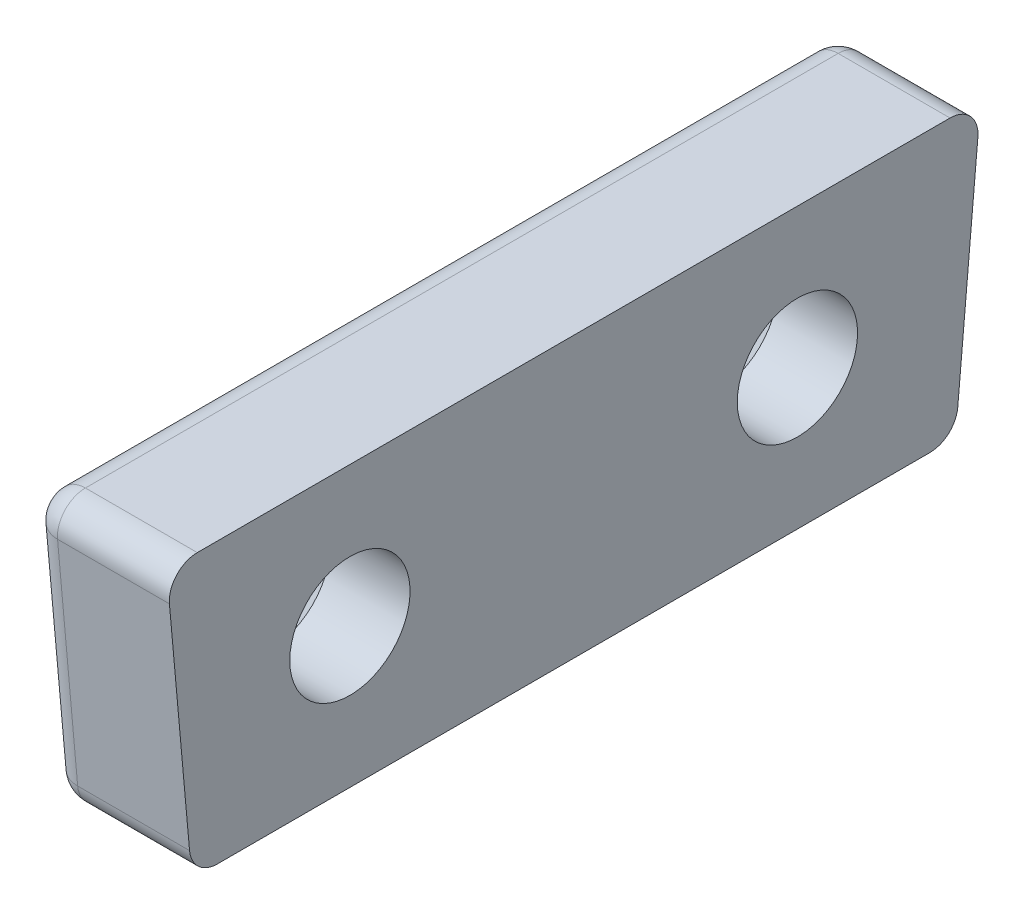
ISO-10303-21;
HEADER;
FILE_DESCRIPTION(('STEP AP214'),'2;1');
FILE_NAME('part.step','',(''),(''),'','','');
FILE_SCHEMA(('AUTOMOTIVE_DESIGN { 1 0 10303 214 1 1 1 1 }'));
ENDSEC;
DATA;
#1=APPLICATION_CONTEXT('core data for automotive mechanical design processes');
#2=APPLICATION_PROTOCOL_DEFINITION('international standard','automotive_design',2000,#1);
#3=PRODUCT_CONTEXT('',#1,'mechanical');
#4=PRODUCT('Part','Part','',(#3));
#5=PRODUCT_RELATED_PRODUCT_CATEGORY('part','',(#4));
#6=PRODUCT_DEFINITION_FORMATION('','',#4);
#7=PRODUCT_DEFINITION_CONTEXT('part definition',#1,'design');
#8=PRODUCT_DEFINITION('design','',#6,#7);
#9=PRODUCT_DEFINITION_SHAPE('','',#8);
#10=(LENGTH_UNIT() NAMED_UNIT(*) SI_UNIT(.MILLI.,.METRE.));
#11=(NAMED_UNIT(*) PLANE_ANGLE_UNIT() SI_UNIT($,.RADIAN.));
#12=(NAMED_UNIT(*) SI_UNIT($,.STERADIAN.) SOLID_ANGLE_UNIT());
#13=UNCERTAINTY_MEASURE_WITH_UNIT(LENGTH_MEASURE(1.E-05),#10,'distance_accuracy_value','');
#14=(GEOMETRIC_REPRESENTATION_CONTEXT(3) GLOBAL_UNCERTAINTY_ASSIGNED_CONTEXT((#13)) GLOBAL_UNIT_ASSIGNED_CONTEXT((#10,
#11,#12)) REPRESENTATION_CONTEXT('',''));
#15=CARTESIAN_POINT('',(0.,0.,0.));
#16=DIRECTION('',(0.,0.,1.));
#17=DIRECTION('',(1.,0.,0.));
#18=AXIS2_PLACEMENT_3D('',#15,#16,#17);
#19=CARTESIAN_POINT('',(0.,0.,0.));
#20=DIRECTION('',(1.,0.,0.));
#21=DIRECTION('',(0.,0.,-1.));
#22=AXIS2_PLACEMENT_3D('',#19,#20,#21);
#23=PLANE('',#22);
#24=CARTESIAN_POINT('',(0.,13.,-38.));
#25=DIRECTION('',(-1.,0.,0.));
#26=DIRECTION('',(0.,0.,1.));
#27=AXIS2_PLACEMENT_3D('',#24,#25,#26);
#28=CIRCLE('',#27,4.3);
#29=CARTESIAN_POINT('',(0.,9.,-36.422026616194));
#30=VERTEX_POINT('',#29);
#31=CARTESIAN_POINT('',(0.,17.,-36.422026616194));
#32=VERTEX_POINT('',#31);
#33=EDGE_CURVE('E348',#30,#32,#28,.T.);
#34=ORIENTED_EDGE('',*,*,#33,.F.);
#35=DIRECTION('',(0.,0.,-1.));
#36=VECTOR('',#35,1.);
#37=CARTESIAN_POINT('',(0.,9.,0.));
#38=LINE('',#37,#36);
#39=CARTESIAN_POINT('',(0.,9.,-23.577973383806));
#40=VERTEX_POINT('',#39);
#41=EDGE_CURVE('E190',#30,#40,#38,.F.);
#42=ORIENTED_EDGE('',*,*,#41,.T.);
#43=CARTESIAN_POINT('',(0.,13.,-22.));
#44=DIRECTION('',(-1.,0.,0.));
#45=DIRECTION('',(0.,0.,1.));
#46=AXIS2_PLACEMENT_3D('',#43,#44,#45);
#47=CIRCLE('',#46,4.3);
#48=CARTESIAN_POINT('',(0.,17.,-23.577973383806));
#49=VERTEX_POINT('',#48);
#50=EDGE_CURVE('E312',#49,#40,#47,.T.);
#51=ORIENTED_EDGE('',*,*,#50,.F.);
#52=DIRECTION('',(0.,0.,1.));
#53=VECTOR('',#52,1.);
#54=CARTESIAN_POINT('',(0.,17.,0.));
#55=LINE('',#54,#53);
#56=EDGE_CURVE('E188',#49,#32,#55,.F.);
#57=ORIENTED_EDGE('',*,*,#56,.T.);
#58=EDGE_LOOP('',(#34,#42,#51,#57));
#59=FACE_BOUND('',#58,.T.);
#60=ADVANCED_FACE('F45',(#59),#23,.F.);
#61=DIRECTION('',(0.,-0.995979773230106,0.0895784087629745));
#62=VECTOR('',#61,1.);
#63=CARTESIAN_POINT('',(0.,8.08957840876297,-42.6549204081191));
#64=LINE('',#63,#62);
#65=CARTESIAN_POINT('',(0.,17.,-43.4563236183084));
#66=VERTEX_POINT('',#65);
#67=CARTESIAN_POINT('',(0.,9.,-42.736803715028));
#68=VERTEX_POINT('',#67);
#69=EDGE_CURVE('E181',#66,#68,#64,.T.);
#70=ORIENTED_EDGE('',*,*,#69,.T.);
#71=DIRECTION('',(0.,0.,-1.));
#72=VECTOR('',#71,1.);
#73=CARTESIAN_POINT('',(0.,9.,0.));
#74=LINE('',#73,#72);
#75=CARTESIAN_POINT('',(0.,9.,-39.577973383806));
#76=VERTEX_POINT('',#75);
#77=EDGE_CURVE('E185',#68,#76,#74,.F.);
#78=ORIENTED_EDGE('',*,*,#77,.T.);
#79=CARTESIAN_POINT('',(0.,17.,-39.577973383806));
#80=VERTEX_POINT('',#79);
#81=EDGE_CURVE('E351',#80,#76,#28,.T.);
#82=ORIENTED_EDGE('',*,*,#81,.F.);
#83=DIRECTION('',(0.,0.,1.));
#84=VECTOR('',#83,1.);
#85=CARTESIAN_POINT('',(0.,17.,0.));
#86=LINE('',#85,#84);
#87=EDGE_CURVE('E183',#80,#66,#86,.F.);
#88=ORIENTED_EDGE('',*,*,#87,.T.);
#89=EDGE_LOOP('',(#70,#78,#82,#88));
#90=FACE_BOUND('',#89,.T.);
#91=ADVANCED_FACE('F286',(#90),#23,.F.);
#92=CARTESIAN_POINT('',(5.,-3.8302640457931,-42.5868863760978));
#93=DIRECTION('',(0.,-0.0895784087629745,-0.995979773230106));
#94=DIRECTION('',(0.,0.995979773230106,-0.0895784087629745));
#95=AXIS2_PLACEMENT_3D('',#92,#93,#94);
#96=PLANE('',#95);
#97=DIRECTION('',(0.,-0.995979773230106,0.0895784087629745));
#98=VECTOR('',#97,1.);
#99=CARTESIAN_POINT('',(5.,-3.8302640457931,-42.5868863760978));
#100=LINE('',#99,#98);
#101=CARTESIAN_POINT('',(5.,16.910421591237,-44.4523033915385));
#102=VERTEX_POINT('',#101);
#103=CARTESIAN_POINT('',(5.,8.91042159123703,-43.7327834882581));
#104=VERTEX_POINT('',#103);
#105=EDGE_CURVE('E368',#102,#104,#100,.T.);
#106=ORIENTED_EDGE('',*,*,#105,.T.);
#107=DIRECTION('',(-1.,0.,0.));
#108=VECTOR('',#107,1.);
#109=CARTESIAN_POINT('',(0.,8.91042159123703,-43.7327834882581));
#110=LINE('',#109,#108);
#111=CARTESIAN_POINT('',(1.,8.91042159123703,-43.7327834882581));
#112=VERTEX_POINT('',#111);
#113=EDGE_CURVE('E391',#104,#112,#110,.T.);
#114=ORIENTED_EDGE('',*,*,#113,.T.);
#115=DIRECTION('',(0.,-0.995979773230106,0.0895784087629745));
#116=VECTOR('',#115,1.);
#117=CARTESIAN_POINT('',(1.,18.,-44.5503000604497));
#118=LINE('',#117,#116);
#119=CARTESIAN_POINT('',(1.,16.910421591237,-44.4523033915385));
#120=VERTEX_POINT('',#119);
#121=EDGE_CURVE('E396',#112,#120,#118,.F.);
#122=ORIENTED_EDGE('',*,*,#121,.T.);
#123=DIRECTION('',(-1.,0.,0.));
#124=VECTOR('',#123,1.);
#125=CARTESIAN_POINT('',(5.,16.910421591237,-44.4523033915385));
#126=LINE('',#125,#124);
#127=EDGE_CURVE('E394',#120,#102,#126,.F.);
#128=ORIENTED_EDGE('',*,*,#127,.T.);
#129=EDGE_LOOP('',(#106,#114,#122,#128));
#130=FACE_BOUND('',#129,.T.);
#131=ADVANCED_FACE('F249',(#130),#96,.T.);
#132=CARTESIAN_POINT('',(5.,18.,0.));
#133=DIRECTION('',(0.,-1.,0.));
#134=DIRECTION('',(0.,0.,-1.));
#135=AXIS2_PLACEMENT_3D('',#132,#133,#134);
#136=PLANE('',#135);
#137=DIRECTION('',(0.,0.,1.));
#138=VECTOR('',#137,1.);
#139=CARTESIAN_POINT('',(1.,18.,0.));
#140=LINE('',#139,#138);
#141=CARTESIAN_POINT('',(1.,18.,-43.4563236183084));
#142=VERTEX_POINT('',#141);
#143=CARTESIAN_POINT('',(1.,18.,-16.5436763816916));
#144=VERTEX_POINT('',#143);
#145=EDGE_CURVE('E401',#142,#144,#140,.T.);
#146=ORIENTED_EDGE('',*,*,#145,.T.);
#147=DIRECTION('',(-1.,0.,0.));
#148=VECTOR('',#147,1.);
#149=CARTESIAN_POINT('',(5.,18.,-16.5436763816916));
#150=LINE('',#149,#148);
#151=CARTESIAN_POINT('',(5.,18.,-16.5436763816916));
#152=VERTEX_POINT('',#151);
#153=EDGE_CURVE('E382',#144,#152,#150,.F.);
#154=ORIENTED_EDGE('',*,*,#153,.T.);
#155=DIRECTION('',(0.,0.,1.));
#156=VECTOR('',#155,1.);
#157=CARTESIAN_POINT('',(5.,18.,0.));
#158=LINE('',#157,#156);
#159=CARTESIAN_POINT('',(5.,18.,-43.4563236183084));
#160=VERTEX_POINT('',#159);
#161=EDGE_CURVE('E371',#160,#152,#158,.T.);
#162=ORIENTED_EDGE('',*,*,#161,.F.);
#163=DIRECTION('',(-1.,0.,0.));
#164=VECTOR('',#163,1.);
#165=CARTESIAN_POINT('',(0.,18.,-43.4563236183084));
#166=LINE('',#165,#164);
#167=EDGE_CURVE('E240',#160,#142,#166,.T.);
#168=ORIENTED_EDGE('',*,*,#167,.T.);
#169=EDGE_LOOP('',(#146,#154,#162,#168));
#170=FACE_BOUND('',#169,.T.);
#171=ADVANCED_FACE('F403',(#170),#136,.F.);
#172=CARTESIAN_POINT('',(5.,1.52283294897056,-16.9316561449118));
#173=DIRECTION('',(0.,0.0895784087629742,-0.995979773230106));
#174=DIRECTION('',(0.,0.995979773230106,0.0895784087629742));
#175=AXIS2_PLACEMENT_3D('',#172,#173,#174);
#176=PLANE('',#175);
#177=DIRECTION('',(0.,-0.995979773230106,-0.0895784087629742));
#178=VECTOR('',#177,1.);
#179=CARTESIAN_POINT('',(5.,1.52283294897056,-16.9316561449118));
#180=LINE('',#179,#178);
#181=CARTESIAN_POINT('',(5.,16.910421591237,-15.5476966084615));
#182=VERTEX_POINT('',#181);
#183=CARTESIAN_POINT('',(5.,8.91042159123703,-16.2672165117419));
#184=VERTEX_POINT('',#183);
#185=EDGE_CURVE('E153',#182,#184,#180,.T.);
#186=ORIENTED_EDGE('',*,*,#185,.F.);
#187=DIRECTION('',(-1.,0.,0.));
#188=VECTOR('',#187,1.);
#189=CARTESIAN_POINT('',(5.,16.910421591237,-15.5476966084615));
#190=LINE('',#189,#188);
#191=CARTESIAN_POINT('',(1.,16.910421591237,-15.5476966084615));
#192=VERTEX_POINT('',#191);
#193=EDGE_CURVE('E62',#182,#192,#190,.T.);
#194=ORIENTED_EDGE('',*,*,#193,.T.);
#195=DIRECTION('',(0.,-0.995979773230106,-0.0895784087629742));
#196=VECTOR('',#195,1.);
#197=CARTESIAN_POINT('',(1.,1.52283294897056,-16.9316561449118));
#198=LINE('',#197,#196);
#199=CARTESIAN_POINT('',(1.,8.91042159123703,-16.2672165117419));
#200=VERTEX_POINT('',#199);
#201=EDGE_CURVE('E67',#192,#200,#198,.T.);
#202=ORIENTED_EDGE('',*,*,#201,.T.);
#203=DIRECTION('',(-1.,0.,0.));
#204=VECTOR('',#203,1.);
#205=CARTESIAN_POINT('',(5.,8.91042159123703,-16.2672165117419));
#206=LINE('',#205,#204);
#207=EDGE_CURVE('E385',#200,#184,#206,.F.);
#208=ORIENTED_EDGE('',*,*,#207,.T.);
#209=EDGE_LOOP('',(#186,#194,#202,#208));
#210=FACE_BOUND('',#209,.T.);
#211=ADVANCED_FACE('F533',(#210),#176,.F.);
#212=CARTESIAN_POINT('',(5.,8.,0.));
#213=DIRECTION('',(0.,1.,0.));
#214=DIRECTION('',(0.,0.,1.));
#215=AXIS2_PLACEMENT_3D('',#212,#213,#214);
#216=PLANE('',#215);
#217=DIRECTION('',(0.,0.,-1.));
#218=VECTOR('',#217,1.);
#219=CARTESIAN_POINT('',(5.,8.,0.));
#220=LINE('',#219,#218);
#221=CARTESIAN_POINT('',(5.,8.,-17.263196284972));
#222=VERTEX_POINT('',#221);
#223=CARTESIAN_POINT('',(5.,8.,-42.736803715028));
#224=VERTEX_POINT('',#223);
#225=EDGE_CURVE('E151',#222,#224,#220,.T.);
#226=ORIENTED_EDGE('',*,*,#225,.F.);
#227=DIRECTION('',(-1.,0.,0.));
#228=VECTOR('',#227,1.);
#229=CARTESIAN_POINT('',(5.,8.,-17.263196284972));
#230=LINE('',#229,#228);
#231=CARTESIAN_POINT('',(1.,8.,-17.263196284972));
#232=VERTEX_POINT('',#231);
#233=EDGE_CURVE('E161',#222,#232,#230,.T.);
#234=ORIENTED_EDGE('',*,*,#233,.T.);
#235=DIRECTION('',(0.,0.,-1.));
#236=VECTOR('',#235,1.);
#237=CARTESIAN_POINT('',(1.,8.,0.));
#238=LINE('',#237,#236);
#239=CARTESIAN_POINT('',(1.,8.,-42.736803715028));
#240=VERTEX_POINT('',#239);
#241=EDGE_CURVE('E171',#232,#240,#238,.T.);
#242=ORIENTED_EDGE('',*,*,#241,.T.);
#243=DIRECTION('',(-1.,0.,0.));
#244=VECTOR('',#243,1.);
#245=CARTESIAN_POINT('',(5.,8.,-42.736803715028));
#246=LINE('',#245,#244);
#247=EDGE_CURVE('E164',#240,#224,#246,.F.);
#248=ORIENTED_EDGE('',*,*,#247,.T.);
#249=EDGE_LOOP('',(#226,#234,#242,#248));
#250=FACE_BOUND('',#249,.T.);
#251=ADVANCED_FACE('F159',(#250),#216,.F.);
#252=CARTESIAN_POINT('',(5.,0.,0.));
#253=DIRECTION('',(1.,0.,0.));
#254=DIRECTION('',(0.,0.,-1.));
#255=AXIS2_PLACEMENT_3D('',#252,#253,#254);
#256=PLANE('',#255);
#257=CARTESIAN_POINT('',(5.,13.,-38.));
#258=DIRECTION('',(-1.,0.,0.));
#259=DIRECTION('',(0.,0.,1.));
#260=AXIS2_PLACEMENT_3D('',#257,#258,#259);
#261=CIRCLE('',#260,2.15);
#262=CARTESIAN_POINT('',(5.,13.,-35.85));
#263=VERTEX_POINT('',#262);
#264=EDGE_CURVE('E313',#263,#263,#261,.T.);
#265=ORIENTED_EDGE('',*,*,#264,.T.);
#266=EDGE_LOOP('',(#265));
#267=FACE_BOUND('',#266,.T.);
#268=CARTESIAN_POINT('',(5.,13.,-22.));
#269=DIRECTION('',(-1.,0.,0.));
#270=DIRECTION('',(0.,0.,1.));
#271=AXIS2_PLACEMENT_3D('',#268,#269,#270);
#272=CIRCLE('',#271,2.15);
#273=CARTESIAN_POINT('',(5.,13.,-19.85));
#274=VERTEX_POINT('',#273);
#275=EDGE_CURVE('E365',#274,#274,#272,.T.);
#276=ORIENTED_EDGE('',*,*,#275,.T.);
#277=EDGE_LOOP('',(#276));
#278=FACE_BOUND('',#277,.T.);
#279=ORIENTED_EDGE('',*,*,#161,.T.);
#280=CARTESIAN_POINT('',(5.,17.,-16.5436763816916));
#281=DIRECTION('',(1.,0.,0.));
#282=DIRECTION('',(0.,0.,-1.));
#283=AXIS2_PLACEMENT_3D('',#280,#281,#282);
#284=CIRCLE('',#283,1.);
#285=EDGE_CURVE('E11',#152,#182,#284,.T.);
#286=ORIENTED_EDGE('',*,*,#285,.T.);
#287=ORIENTED_EDGE('',*,*,#185,.T.);
#288=CARTESIAN_POINT('',(5.,9.,-17.263196284972));
#289=DIRECTION('',(1.,0.,0.));
#290=DIRECTION('',(0.,0.,-1.));
#291=AXIS2_PLACEMENT_3D('',#288,#289,#290);
#292=CIRCLE('',#291,1.);
#293=EDGE_CURVE('E54',#184,#222,#292,.T.);
#294=ORIENTED_EDGE('',*,*,#293,.T.);
#295=ORIENTED_EDGE('',*,*,#225,.T.);
#296=CARTESIAN_POINT('',(5.,9.,-42.736803715028));
#297=DIRECTION('',(1.,0.,0.));
#298=DIRECTION('',(0.,0.,-1.));
#299=AXIS2_PLACEMENT_3D('',#296,#297,#298);
#300=CIRCLE('',#299,1.);
#301=EDGE_CURVE('E156',#224,#104,#300,.T.);
#302=ORIENTED_EDGE('',*,*,#301,.T.);
#303=ORIENTED_EDGE('',*,*,#105,.F.);
#304=CARTESIAN_POINT('',(5.,17.,-43.4563236183084));
#305=DIRECTION('',(1.,0.,0.));
#306=DIRECTION('',(0.,0.,-1.));
#307=AXIS2_PLACEMENT_3D('',#304,#305,#306);
#308=CIRCLE('',#307,1.);
#309=EDGE_CURVE('E377',#102,#160,#308,.T.);
#310=ORIENTED_EDGE('',*,*,#309,.T.);
#311=EDGE_LOOP('',(#279,#286,#287,#294,#295,#302,#303,#310));
#312=FACE_BOUND('',#311,.T.);
#313=ADVANCED_FACE('F150',(#267,#278,#312),#256,.T.);
#314=CARTESIAN_POINT('',(0.,9.,-20.422026616194));
#315=VERTEX_POINT('',#314);
#316=CARTESIAN_POINT('',(0.,17.,-20.422026616194));
#317=VERTEX_POINT('',#316);
#318=EDGE_CURVE('E306',#315,#317,#47,.T.);
#319=ORIENTED_EDGE('',*,*,#318,.F.);
#320=DIRECTION('',(0.,0.,-1.));
#321=VECTOR('',#320,1.);
#322=CARTESIAN_POINT('',(0.,9.,0.));
#323=LINE('',#322,#321);
#324=CARTESIAN_POINT('',(0.,9.,-17.263196284972));
#325=VERTEX_POINT('',#324);
#326=EDGE_CURVE('E179',#315,#325,#323,.F.);
#327=ORIENTED_EDGE('',*,*,#326,.T.);
#328=DIRECTION('',(0.,-0.995979773230106,-0.0895784087629742));
#329=VECTOR('',#328,1.);
#330=CARTESIAN_POINT('',(0.,1.61241135773354,-17.9276359181419));
#331=LINE('',#330,#329);
#332=CARTESIAN_POINT('',(0.,17.,-16.5436763816916));
#333=VERTEX_POINT('',#332);
#334=EDGE_CURVE('E170',#325,#333,#331,.F.);
#335=ORIENTED_EDGE('',*,*,#334,.T.);
#336=DIRECTION('',(0.,0.,1.));
#337=VECTOR('',#336,1.);
#338=CARTESIAN_POINT('',(0.,17.,0.));
#339=LINE('',#338,#337);
#340=EDGE_CURVE('E173',#333,#317,#339,.F.);
#341=ORIENTED_EDGE('',*,*,#340,.T.);
#342=EDGE_LOOP('',(#319,#327,#335,#341));
#343=FACE_BOUND('',#342,.T.);
#344=ADVANCED_FACE('F289',(#343),#23,.F.);
#345=CARTESIAN_POINT('',(0.,13.,-22.));
#346=DIRECTION('',(-1.,0.,0.));
#347=DIRECTION('',(0.,0.,1.));
#348=AXIS2_PLACEMENT_3D('',#345,#346,#347);
#349=CYLINDRICAL_SURFACE('',#348,2.15);
#350=ORIENTED_EDGE('',*,*,#275,.F.);
#351=EDGE_LOOP('',(#350));
#352=FACE_BOUND('',#351,.T.);
#353=CARTESIAN_POINT('',(2.15,13.,-22.));
#354=DIRECTION('',(-1.,0.,0.));
#355=DIRECTION('',(0.,0.,1.));
#356=AXIS2_PLACEMENT_3D('',#353,#354,#355);
#357=CIRCLE('',#356,2.15);
#358=CARTESIAN_POINT('',(2.15,13.,-19.85));
#359=VERTEX_POINT('',#358);
#360=EDGE_CURVE('E362',#359,#359,#357,.T.);
#361=ORIENTED_EDGE('',*,*,#360,.T.);
#362=EDGE_LOOP('',(#361));
#363=FACE_BOUND('',#362,.T.);
#364=ADVANCED_FACE('F224',(#352,#363),#349,.F.);
#365=CARTESIAN_POINT('',(0.,13.,-22.));
#366=DIRECTION('',(-1.,0.,0.));
#367=DIRECTION('',(0.,0.,1.));
#368=AXIS2_PLACEMENT_3D('',#365,#366,#367);
#369=CONICAL_SURFACE('',#368,4.3,0.785398163397449);
#370=ORIENTED_EDGE('',*,*,#360,.F.);
#371=EDGE_LOOP('',(#370));
#372=FACE_BOUND('',#371,.T.);
#373=ORIENTED_EDGE('',*,*,#50,.T.);
#374=CARTESIAN_POINT('',(0.,9.,-23.577973383806));
#375=CARTESIAN_POINT('',(2.15460257915566E-05,8.98038714909841,-23.5281997595273));
#376=CARTESIAN_POINT('',(0.000576796634793538,8.96221014052615,-23.4778881084532));
#377=CARTESIAN_POINT('',(0.00241404624280023,8.9284536276547,-23.3764475989757));
#378=CARTESIAN_POINT('',(0.00369555683155119,8.91287238680296,-23.3253193121935));
#379=CARTESIAN_POINT('',(0.00664268296572166,8.88403626949844,-23.2225389196867));
#380=CARTESIAN_POINT('',(0.00830753175784137,8.87077684093773,-23.1708880538095));
#381=CARTESIAN_POINT('',(0.011798155819522,8.84634771924702,-23.0670933717497));
#382=CARTESIAN_POINT('',(0.0136239627346892,8.83517843841014,-23.0149494604378));
#383=CARTESIAN_POINT('',(0.0190952475466777,8.80437025102447,-22.8569738140176));
#384=CARTESIAN_POINT('',(0.0227000150935194,8.78769183814442,-22.7505537329624));
#385=CARTESIAN_POINT('',(0.0288134087130696,8.76130921086201,-22.5367844066941));
#386=CARTESIAN_POINT('',(0.0313213322316277,8.75160946389984,-22.4294346107319));
#387=CARTESIAN_POINT('',(0.0352192103545663,8.73678179754204,-22.1817171801764));
#388=CARTESIAN_POINT('',(0.0360403854039108,8.73392881430962,-22.0411982074854));
#389=CARTESIAN_POINT('',(0.0346427525346378,8.73906412637083,-21.760315621088));
#390=CARTESIAN_POINT('',(0.0324223365647824,8.74705815632393,-21.6199521288565));
#391=CARTESIAN_POINT('',(0.0256611853543365,8.77444393513213,-21.341100801979));
#392=CARTESIAN_POINT('',(0.0211330189056625,8.79377402899599,-21.2026069357388));
#393=CARTESIAN_POINT('',(0.0140431471968662,8.83251484888178,-20.9968263271746));
#394=CARTESIAN_POINT('',(0.0116316829562863,8.84704190451276,-20.9285970565113));
#395=CARTESIAN_POINT('',(0.00712275123751167,8.87970728104223,-20.7930051677484));
#396=CARTESIAN_POINT('',(0.0050251725338099,8.89784431740846,-20.7256422504271));
#397=CARTESIAN_POINT('',(0.00237087663047839,8.93012127539742,-20.6188960104536));
#398=CARTESIAN_POINT('',(0.00153355144594358,8.94294872764027,-20.5791220774121));
#399=CARTESIAN_POINT('',(0.000352141304464339,8.97022261642885,-20.5001294003564));
#400=CARTESIAN_POINT('',(8.03504861740936E-06,8.98466898303521,-20.4609106324407));
#401=CARTESIAN_POINT('',(0.,9.00000000000001,-20.422026616194));
#402=B_SPLINE_CURVE_WITH_KNOTS('',3,(#374,#375,#376,#377,#378,#379,#380,#381,#382,#383,#384,
#385,#386,#387,#388,#389,#390,#391,#392,#393,#394,#395,#396,#397,#398,#399,#400,#401),
.UNSPECIFIED.,.F.,.F.,(4,2,2,2,2,2,2,2,2,2,2,2,2,4),(0.,0.160433499756164,0.320759235703861,
0.480767031751769,0.640806357024161,0.96385067146623,1.28710160135282,1.70827121625085,
2.12966358423113,2.54878504940699,2.75811204934582,2.96736469760493,3.09272967556698,
3.21808923967173),.UNSPECIFIED.);
#403=EDGE_CURVE('E234',#40,#315,#402,.T.);
#404=ORIENTED_EDGE('',*,*,#403,.T.);
#405=ORIENTED_EDGE('',*,*,#318,.T.);
#406=CARTESIAN_POINT('',(0.,17.,-20.422026616194));
#407=CARTESIAN_POINT('',(2.15460257914368E-05,17.0196128509016,-20.4718002404727));
#408=CARTESIAN_POINT('',(0.000576796634793419,17.0377898594739,-20.5221118915468));
#409=CARTESIAN_POINT('',(0.00241404624280015,17.0715463723453,-20.6235524010243));
#410=CARTESIAN_POINT('',(0.00369555683155113,17.087127613197,-20.6746806878065));
#411=CARTESIAN_POINT('',(0.00664268296572155,17.1159637305016,-20.7774610803133));
#412=CARTESIAN_POINT('',(0.00830753175784119,17.1292231590623,-20.8291119461905));
#413=CARTESIAN_POINT('',(0.011798155819522,17.153652280753,-20.9329066282502));
#414=CARTESIAN_POINT('',(0.0136239627346894,17.1648215615899,-20.9850505395622));
#415=CARTESIAN_POINT('',(0.0190952475466781,17.1956297489755,-21.1430261859824));
#416=CARTESIAN_POINT('',(0.0227000150935194,17.2123081618556,-21.2494462670376));
#417=CARTESIAN_POINT('',(0.0288134087130694,17.238690789138,-21.4632155933059));
#418=CARTESIAN_POINT('',(0.0313213322316276,17.2483905361002,-21.5705653892681));
#419=CARTESIAN_POINT('',(0.0352192103545663,17.263218202458,-21.8182828198236));
#420=CARTESIAN_POINT('',(0.0360403854039108,17.2660711856904,-21.9588017925146));
#421=CARTESIAN_POINT('',(0.0346427525346377,17.2609358736292,-22.2396843789119));
#422=CARTESIAN_POINT('',(0.0324223365647823,17.2529418436761,-22.3800478711435));
#423=CARTESIAN_POINT('',(0.0256611853543364,17.2255560648679,-22.658899198021));
#424=CARTESIAN_POINT('',(0.0211330189056625,17.206225971004,-22.7973930642612));
#425=CARTESIAN_POINT('',(0.0140431471968664,17.1674851511182,-23.0031736728254));
#426=CARTESIAN_POINT('',(0.0116316829562866,17.1529580954872,-23.0714029434887));
#427=CARTESIAN_POINT('',(0.00712275123751173,17.1202927189578,-23.2069948322516));
#428=CARTESIAN_POINT('',(0.00502517253380966,17.1021556825915,-23.2743577495729));
#429=CARTESIAN_POINT('',(0.00237087663047826,17.0698787246026,-23.3811039895464));
#430=CARTESIAN_POINT('',(0.00153355144594364,17.0570512723597,-23.4208779225878));
#431=CARTESIAN_POINT('',(0.00035214130446454,17.0297773835711,-23.4998705996435));
#432=CARTESIAN_POINT('',(8.03504861757495E-06,17.0153310169648,-23.5390893675593));
#433=CARTESIAN_POINT('',(0.,17.,-23.5779733838059));
#434=B_SPLINE_CURVE_WITH_KNOTS('',3,(#406,#407,#408,#409,#410,#411,#412,#413,#414,#415,#416,
#417,#418,#419,#420,#421,#422,#423,#424,#425,#426,#427,#428,#429,#430,#431,#432,#433),
.UNSPECIFIED.,.F.,.F.,(4,2,2,2,2,2,2,2,2,2,2,2,2,4),(0.,0.160433499756167,0.320759235703861,
0.480767031751769,0.640806357024161,0.96385067146623,1.28710160135282,1.70827121625084,
2.12966358423112,2.54878504940699,2.75811204934581,2.96736469760493,3.09272967556697,
3.21808923967172),.UNSPECIFIED.);
#435=EDGE_CURVE('E228',#317,#49,#434,.T.);
#436=ORIENTED_EDGE('',*,*,#435,.T.);
#437=EDGE_LOOP('',(#373,#404,#405,#436));
#438=FACE_BOUND('',#437,.T.);
#439=ADVANCED_FACE('F219',(#372,#438),#369,.F.);
#440=CARTESIAN_POINT('',(0.,13.,-38.));
#441=DIRECTION('',(-1.,0.,0.));
#442=DIRECTION('',(0.,0.,1.));
#443=AXIS2_PLACEMENT_3D('',#440,#441,#442);
#444=CYLINDRICAL_SURFACE('',#443,2.15);
#445=ORIENTED_EDGE('',*,*,#264,.F.);
#446=EDGE_LOOP('',(#445));
#447=FACE_BOUND('',#446,.T.);
#448=CARTESIAN_POINT('',(2.15,13.,-38.));
#449=DIRECTION('',(-1.,0.,0.));
#450=DIRECTION('',(0.,0.,1.));
#451=AXIS2_PLACEMENT_3D('',#448,#449,#450);
#452=CIRCLE('',#451,2.15);
#453=CARTESIAN_POINT('',(2.15,13.,-35.85));
#454=VERTEX_POINT('',#453);
#455=EDGE_CURVE('E356',#454,#454,#452,.T.);
#456=ORIENTED_EDGE('',*,*,#455,.T.);
#457=EDGE_LOOP('',(#456));
#458=FACE_BOUND('',#457,.T.);
#459=ADVANCED_FACE('F214',(#447,#458),#444,.F.);
#460=CARTESIAN_POINT('',(0.,13.,-38.));
#461=DIRECTION('',(-1.,0.,0.));
#462=DIRECTION('',(0.,0.,1.));
#463=AXIS2_PLACEMENT_3D('',#460,#461,#462);
#464=CONICAL_SURFACE('',#463,4.3,0.785398163397449);
#465=ORIENTED_EDGE('',*,*,#455,.F.);
#466=EDGE_LOOP('',(#465));
#467=FACE_BOUND('',#466,.T.);
#468=ORIENTED_EDGE('',*,*,#81,.T.);
#469=CARTESIAN_POINT('',(0.,9.,-39.577973383806));
#470=CARTESIAN_POINT('',(2.15460257916196E-05,8.98038714909841,-39.5281997595273));
#471=CARTESIAN_POINT('',(0.000576796634793489,8.96221014052615,-39.4778881084533));
#472=CARTESIAN_POINT('',(0.00241404624279993,8.9284536276547,-39.3764475989757));
#473=CARTESIAN_POINT('',(0.00369555683155077,8.91287238680296,-39.3253193121935));
#474=CARTESIAN_POINT('',(0.00664268296572127,8.88403626949844,-39.2225389196867));
#475=CARTESIAN_POINT('',(0.00830753175784111,8.87077684093773,-39.1708880538095));
#476=CARTESIAN_POINT('',(0.011798155819522,8.84634771924702,-39.0670933717498));
#477=CARTESIAN_POINT('',(0.0136239627346894,8.83517843841014,-39.0149494604378));
#478=CARTESIAN_POINT('',(0.0190952475466779,8.80437025102447,-38.8569738140176));
#479=CARTESIAN_POINT('',(0.0227000150935192,8.78769183814442,-38.7505537329624));
#480=CARTESIAN_POINT('',(0.0288134087130693,8.76130921086201,-38.5367844066941));
#481=CARTESIAN_POINT('',(0.0313213322316276,8.75160946389984,-38.4294346107319));
#482=CARTESIAN_POINT('',(0.0352192103545664,8.73678179754203,-38.1817171801764));
#483=CARTESIAN_POINT('',(0.036040385403911,8.73392881430962,-38.0411982074854));
#484=CARTESIAN_POINT('',(0.0346427525346378,8.73906412637083,-37.760315621088));
#485=CARTESIAN_POINT('',(0.0324223365647822,8.74705815632393,-37.6199521288565));
#486=CARTESIAN_POINT('',(0.0256611853543364,8.77444393513213,-37.341100801979));
#487=CARTESIAN_POINT('',(0.0211330189056626,8.79377402899599,-37.2026069357388));
#488=CARTESIAN_POINT('',(0.0140431471968663,8.83251484888178,-36.9968263271746));
#489=CARTESIAN_POINT('',(0.0116316829562864,8.84704190451276,-36.9285970565113));
#490=CARTESIAN_POINT('',(0.00712275123751144,8.87970728104224,-36.7930051677484));
#491=CARTESIAN_POINT('',(0.00502517253380932,8.89784431740846,-36.7256422504271));
#492=CARTESIAN_POINT('',(0.00237087663047803,8.93012127539742,-36.6188960104536));
#493=CARTESIAN_POINT('',(0.00153355144594348,8.94294872764027,-36.5791220774121));
#494=CARTESIAN_POINT('',(0.000352141304464567,8.97022261642885,-36.5001294003564));
#495=CARTESIAN_POINT('',(8.03504861767803E-06,8.98466898303521,-36.4609106324407));
#496=CARTESIAN_POINT('',(0.,9.00000000000001,-36.422026616194));
#497=B_SPLINE_CURVE_WITH_KNOTS('',3,(#469,#470,#471,#472,#473,#474,#475,#476,#477,#478,#479,
#480,#481,#482,#483,#484,#485,#486,#487,#488,#489,#490,#491,#492,#493,#494,#495,#496),
.UNSPECIFIED.,.F.,.F.,(4,2,2,2,2,2,2,2,2,2,2,2,2,4),(0.,0.16043349975616,0.320759235703857,
0.480767031751765,0.640806357024165,0.96385067146623,1.28710160135282,1.70827121625084,
2.12966358423112,2.54878504940699,2.75811204934582,2.96736469760493,3.09272967556698,
3.21808923967173),.UNSPECIFIED.);
#498=EDGE_CURVE('E200',#76,#30,#497,.T.);
#499=ORIENTED_EDGE('',*,*,#498,.T.);
#500=ORIENTED_EDGE('',*,*,#33,.T.);
#501=CARTESIAN_POINT('',(0.,17.,-36.422026616194));
#502=CARTESIAN_POINT('',(2.15460257916744E-05,17.0196128509016,-36.4718002404727));
#503=CARTESIAN_POINT('',(0.00057679663479364,17.0377898594738,-36.5221118915467));
#504=CARTESIAN_POINT('',(0.00241404624280022,17.0715463723453,-36.6235524010243));
#505=CARTESIAN_POINT('',(0.00369555683155112,17.087127613197,-36.6746806878065));
#506=CARTESIAN_POINT('',(0.00664268296572151,17.1159637305016,-36.7774610803133));
#507=CARTESIAN_POINT('',(0.00830753175784118,17.1292231590623,-36.8291119461905));
#508=CARTESIAN_POINT('',(0.0117981558195221,17.153652280753,-36.9329066282503));
#509=CARTESIAN_POINT('',(0.0136239627346895,17.1648215615899,-36.9850505395622));
#510=CARTESIAN_POINT('',(0.0190952475466782,17.1956297489755,-37.1430261859824));
#511=CARTESIAN_POINT('',(0.0227000150935197,17.2123081618556,-37.2494462670376));
#512=CARTESIAN_POINT('',(0.0288134087130697,17.238690789138,-37.4632155933059));
#513=CARTESIAN_POINT('',(0.0313213322316278,17.2483905361002,-37.5705653892681));
#514=CARTESIAN_POINT('',(0.0352192103545663,17.263218202458,-37.8182828198236));
#515=CARTESIAN_POINT('',(0.0360403854039108,17.2660711856904,-37.9588017925146));
#516=CARTESIAN_POINT('',(0.0346427525346377,17.2609358736292,-38.239684378912));
#517=CARTESIAN_POINT('',(0.0324223365647823,17.2529418436761,-38.3800478711435));
#518=CARTESIAN_POINT('',(0.0256611853543363,17.2255560648679,-38.658899198021));
#519=CARTESIAN_POINT('',(0.0211330189056622,17.206225971004,-38.7973930642612));
#520=CARTESIAN_POINT('',(0.0140431471968661,17.1674851511182,-39.0031736728254));
#521=CARTESIAN_POINT('',(0.0116316829562863,17.1529580954872,-39.0714029434887));
#522=CARTESIAN_POINT('',(0.00712275123751148,17.1202927189578,-39.2069948322516));
#523=CARTESIAN_POINT('',(0.00502517253380933,17.1021556825915,-39.2743577495729));
#524=CARTESIAN_POINT('',(0.00237087663047803,17.0698787246026,-39.3811039895464));
#525=CARTESIAN_POINT('',(0.00153355144594349,17.0570512723597,-39.4208779225879));
#526=CARTESIAN_POINT('',(0.000352141304464601,17.0297773835711,-39.4998705996436));
#527=CARTESIAN_POINT('',(8.0350486177234E-06,17.0153310169648,-39.5390893675593));
#528=CARTESIAN_POINT('',(0.,17.,-39.577973383806));
#529=B_SPLINE_CURVE_WITH_KNOTS('',3,(#501,#502,#503,#504,#505,#506,#507,#508,#509,#510,#511,
#512,#513,#514,#515,#516,#517,#518,#519,#520,#521,#522,#523,#524,#525,#526,#527,#528),
.UNSPECIFIED.,.F.,.F.,(4,2,2,2,2,2,2,2,2,2,2,2,2,4),(0.,0.160433499756159,0.320759235703858,
0.480767031751765,0.640806357024172,0.963850671466244,1.28710160135283,1.70827121625085,
2.12966358423113,2.548785049407,2.75811204934582,2.96736469760493,3.09272967556698,
3.21808923967173),.UNSPECIFIED.);
#530=EDGE_CURVE('E192',#32,#80,#529,.T.);
#531=ORIENTED_EDGE('',*,*,#530,.T.);
#532=EDGE_LOOP('',(#468,#499,#500,#531));
#533=FACE_BOUND('',#532,.T.);
#534=ADVANCED_FACE('F210',(#467,#533),#464,.F.);
#535=CARTESIAN_POINT('',(5.,17.,-16.5436763816916));
#536=DIRECTION('',(-1.,0.,0.));
#537=DIRECTION('',(0.,0.,1.));
#538=AXIS2_PLACEMENT_3D('',#535,#536,#537);
#539=CYLINDRICAL_SURFACE('',#538,1.);
#540=ORIENTED_EDGE('',*,*,#285,.F.);
#541=ORIENTED_EDGE('',*,*,#153,.F.);
#542=CARTESIAN_POINT('',(1.,17.,-16.5436763816916));
#543=DIRECTION('',(-1.,0.,0.));
#544=DIRECTION('',(0.,0.,1.));
#545=AXIS2_PLACEMENT_3D('',#542,#543,#544);
#546=CIRCLE('',#545,1.);
#547=EDGE_CURVE('E345',#192,#144,#546,.T.);
#548=ORIENTED_EDGE('',*,*,#547,.F.);
#549=ORIENTED_EDGE('',*,*,#193,.F.);
#550=EDGE_LOOP('',(#540,#541,#548,#549));
#551=FACE_BOUND('',#550,.T.);
#552=ADVANCED_FACE('F47',(#551),#539,.T.);
#553=CARTESIAN_POINT('',(5.,17.,-43.4563236183084));
#554=DIRECTION('',(1.,0.,0.));
#555=DIRECTION('',(0.,0.,-1.));
#556=AXIS2_PLACEMENT_3D('',#553,#554,#555);
#557=CYLINDRICAL_SURFACE('',#556,1.);
#558=ORIENTED_EDGE('',*,*,#309,.F.);
#559=ORIENTED_EDGE('',*,*,#127,.F.);
#560=CARTESIAN_POINT('',(1.,17.,-43.4563236183084));
#561=DIRECTION('',(-1.,0.,0.));
#562=DIRECTION('',(0.,0.,1.));
#563=AXIS2_PLACEMENT_3D('',#560,#561,#562);
#564=CIRCLE('',#563,1.);
#565=EDGE_CURVE('E343',#142,#120,#564,.T.);
#566=ORIENTED_EDGE('',*,*,#565,.F.);
#567=ORIENTED_EDGE('',*,*,#167,.F.);
#568=EDGE_LOOP('',(#558,#559,#566,#567));
#569=FACE_BOUND('',#568,.T.);
#570=ADVANCED_FACE('F282',(#569),#557,.T.);
#571=CARTESIAN_POINT('',(1.,17.,0.));
#572=DIRECTION('',(0.,0.,1.));
#573=DIRECTION('',(1.,0.,0.));
#574=AXIS2_PLACEMENT_3D('',#571,#572,#573);
#575=CYLINDRICAL_SURFACE('',#574,1.);
#576=CARTESIAN_POINT('',(1.,17.,-16.5436763816916));
#577=DIRECTION('',(0.,0.,1.));
#578=DIRECTION('',(1.,0.,0.));
#579=AXIS2_PLACEMENT_3D('',#576,#577,#578);
#580=CIRCLE('',#579,1.);
#581=EDGE_CURVE('E49',#144,#333,#580,.T.);
#582=ORIENTED_EDGE('',*,*,#581,.F.);
#583=ORIENTED_EDGE('',*,*,#145,.F.);
#584=CARTESIAN_POINT('',(1.,17.,-43.4563236183084));
#585=DIRECTION('',(0.,0.,-1.));
#586=DIRECTION('',(-1.,0.,0.));
#587=AXIS2_PLACEMENT_3D('',#584,#585,#586);
#588=CIRCLE('',#587,1.);
#589=EDGE_CURVE('E340',#66,#142,#588,.T.);
#590=ORIENTED_EDGE('',*,*,#589,.F.);
#591=ORIENTED_EDGE('',*,*,#87,.F.);
#592=ORIENTED_EDGE('',*,*,#530,.F.);
#593=ORIENTED_EDGE('',*,*,#56,.F.);
#594=ORIENTED_EDGE('',*,*,#435,.F.);
#595=ORIENTED_EDGE('',*,*,#340,.F.);
#596=EDGE_LOOP('',(#582,#583,#590,#591,#592,#593,#594,#595));
#597=FACE_BOUND('',#596,.T.);
#598=ADVANCED_FACE('F207',(#597),#575,.T.);
#599=CARTESIAN_POINT('',(1.,17.,-16.5436763816916));
#600=DIRECTION('',(-1.,0.,0.));
#601=DIRECTION('',(0.,0.,1.));
#602=AXIS2_PLACEMENT_3D('',#599,#600,#601);
#603=SPHERICAL_SURFACE('',#602,1.);
#604=ORIENTED_EDGE('',*,*,#547,.T.);
#605=ORIENTED_EDGE('',*,*,#581,.T.);
#606=CARTESIAN_POINT('',(1.,17.,-16.5436763816916));
#607=DIRECTION('',(0.,0.995979773230106,0.0895784087629747));
#608=DIRECTION('',(0.,-0.0895784087629748,0.995979773230106));
#609=AXIS2_PLACEMENT_3D('',#606,#607,#608);
#610=CIRCLE('',#609,1.);
#611=EDGE_CURVE('E337',#192,#333,#610,.F.);
#612=ORIENTED_EDGE('',*,*,#611,.F.);
#613=EDGE_LOOP('',(#604,#605,#612));
#614=FACE_BOUND('',#613,.T.);
#615=ADVANCED_FACE('F275',(#614),#603,.T.);
#616=CARTESIAN_POINT('',(1.,17.,-43.4563236183084));
#617=DIRECTION('',(-1.,0.,0.));
#618=DIRECTION('',(0.,0.,1.));
#619=AXIS2_PLACEMENT_3D('',#616,#617,#618);
#620=SPHERICAL_SURFACE('',#619,1.);
#621=ORIENTED_EDGE('',*,*,#589,.T.);
#622=ORIENTED_EDGE('',*,*,#565,.T.);
#623=CARTESIAN_POINT('',(1.,17.,-43.4563236183084));
#624=DIRECTION('',(0.,0.995979773230106,-0.0895784087629747));
#625=DIRECTION('',(0.,0.0895784087629748,0.995979773230106));
#626=AXIS2_PLACEMENT_3D('',#623,#624,#625);
#627=CIRCLE('',#626,1.);
#628=EDGE_CURVE('E334',#66,#120,#627,.F.);
#629=ORIENTED_EDGE('',*,*,#628,.F.);
#630=EDGE_LOOP('',(#621,#622,#629));
#631=FACE_BOUND('',#630,.T.);
#632=ADVANCED_FACE('F272',(#631),#620,.T.);
#633=CARTESIAN_POINT('',(1.,1.61241135773354,-17.9276359181419));
#634=DIRECTION('',(0.,-0.995979773230106,-0.0895784087629742));
#635=DIRECTION('',(0.,0.0895784087629742,-0.995979773230106));
#636=AXIS2_PLACEMENT_3D('',#633,#634,#635);
#637=CYLINDRICAL_SURFACE('',#636,1.);
#638=ORIENTED_EDGE('',*,*,#611,.T.);
#639=ORIENTED_EDGE('',*,*,#334,.F.);
#640=CARTESIAN_POINT('',(1.,9.,-17.263196284972));
#641=DIRECTION('',(0.,-0.995979773230106,-0.0895784087629747));
#642=DIRECTION('',(0.,0.0895784087629748,-0.995979773230106));
#643=AXIS2_PLACEMENT_3D('',#640,#641,#642);
#644=CIRCLE('',#643,1.);
#645=EDGE_CURVE('E332',#200,#325,#644,.T.);
#646=ORIENTED_EDGE('',*,*,#645,.F.);
#647=ORIENTED_EDGE('',*,*,#201,.F.);
#648=EDGE_LOOP('',(#638,#639,#646,#647));
#649=FACE_BOUND('',#648,.T.);
#650=ADVANCED_FACE('F269',(#649),#637,.T.);
#651=CARTESIAN_POINT('',(5.,9.,-17.263196284972));
#652=DIRECTION('',(-1.,0.,0.));
#653=DIRECTION('',(0.,0.,1.));
#654=AXIS2_PLACEMENT_3D('',#651,#652,#653);
#655=CYLINDRICAL_SURFACE('',#654,1.);
#656=ORIENTED_EDGE('',*,*,#293,.F.);
#657=ORIENTED_EDGE('',*,*,#207,.F.);
#658=CARTESIAN_POINT('',(1.,9.,-17.263196284972));
#659=DIRECTION('',(-1.,0.,0.));
#660=DIRECTION('',(0.,0.,1.));
#661=AXIS2_PLACEMENT_3D('',#658,#659,#660);
#662=CIRCLE('',#661,1.);
#663=EDGE_CURVE('E168',#232,#200,#662,.T.);
#664=ORIENTED_EDGE('',*,*,#663,.F.);
#665=ORIENTED_EDGE('',*,*,#233,.F.);
#666=EDGE_LOOP('',(#656,#657,#664,#665));
#667=FACE_BOUND('',#666,.T.);
#668=ADVANCED_FACE('F166',(#667),#655,.T.);
#669=CARTESIAN_POINT('',(5.,9.,-42.736803715028));
#670=DIRECTION('',(1.,0.,0.));
#671=DIRECTION('',(0.,0.,-1.));
#672=AXIS2_PLACEMENT_3D('',#669,#670,#671);
#673=CYLINDRICAL_SURFACE('',#672,1.);
#674=ORIENTED_EDGE('',*,*,#301,.F.);
#675=ORIENTED_EDGE('',*,*,#247,.F.);
#676=CARTESIAN_POINT('',(1.,9.,-42.736803715028));
#677=DIRECTION('',(-1.,0.,0.));
#678=DIRECTION('',(0.,0.,1.));
#679=AXIS2_PLACEMENT_3D('',#676,#677,#678);
#680=CIRCLE('',#679,1.);
#681=EDGE_CURVE('E325',#112,#240,#680,.T.);
#682=ORIENTED_EDGE('',*,*,#681,.F.);
#683=ORIENTED_EDGE('',*,*,#113,.F.);
#684=EDGE_LOOP('',(#674,#675,#682,#683));
#685=FACE_BOUND('',#684,.T.);
#686=ADVANCED_FACE('F262',(#685),#673,.T.);
#687=CARTESIAN_POINT('',(1.,-3.74068563703013,-41.5909066028677));
#688=DIRECTION('',(0.,0.995979773230106,-0.0895784087629745));
#689=DIRECTION('',(0.,0.0895784087629745,0.995979773230106));
#690=AXIS2_PLACEMENT_3D('',#687,#688,#689);
#691=CYLINDRICAL_SURFACE('',#690,1.);
#692=ORIENTED_EDGE('',*,*,#628,.T.);
#693=ORIENTED_EDGE('',*,*,#121,.F.);
#694=CARTESIAN_POINT('',(1.,9.,-42.736803715028));
#695=DIRECTION('',(0.,-0.995979773230106,0.0895784087629754));
#696=DIRECTION('',(0.,-0.0895784087629754,-0.995979773230106));
#697=AXIS2_PLACEMENT_3D('',#694,#695,#696);
#698=CIRCLE('',#697,1.);
#699=EDGE_CURVE('E321',#68,#112,#698,.T.);
#700=ORIENTED_EDGE('',*,*,#699,.F.);
#701=ORIENTED_EDGE('',*,*,#69,.F.);
#702=EDGE_LOOP('',(#692,#693,#700,#701));
#703=FACE_BOUND('',#702,.T.);
#704=ADVANCED_FACE('F258',(#703),#691,.T.);
#705=CARTESIAN_POINT('',(1.,9.,-17.263196284972));
#706=DIRECTION('',(-1.,0.,0.));
#707=DIRECTION('',(0.,0.,1.));
#708=AXIS2_PLACEMENT_3D('',#705,#706,#707);
#709=SPHERICAL_SURFACE('',#708,1.);
#710=ORIENTED_EDGE('',*,*,#663,.T.);
#711=ORIENTED_EDGE('',*,*,#645,.T.);
#712=CARTESIAN_POINT('',(1.,9.,-17.263196284972));
#713=DIRECTION('',(0.,0.,1.));
#714=DIRECTION('',(1.,0.,0.));
#715=AXIS2_PLACEMENT_3D('',#712,#713,#714);
#716=CIRCLE('',#715,1.);
#717=EDGE_CURVE('E319',#232,#325,#716,.F.);
#718=ORIENTED_EDGE('',*,*,#717,.F.);
#719=EDGE_LOOP('',(#710,#711,#718));
#720=FACE_BOUND('',#719,.T.);
#721=ADVANCED_FACE('F254',(#720),#709,.T.);
#722=CARTESIAN_POINT('',(1.,9.,-42.736803715028));
#723=DIRECTION('',(-1.,0.,0.));
#724=DIRECTION('',(0.,0.,1.));
#725=AXIS2_PLACEMENT_3D('',#722,#723,#724);
#726=SPHERICAL_SURFACE('',#725,1.);
#727=ORIENTED_EDGE('',*,*,#699,.T.);
#728=ORIENTED_EDGE('',*,*,#681,.T.);
#729=CARTESIAN_POINT('',(1.,9.,-42.736803715028));
#730=DIRECTION('',(0.,0.,-1.));
#731=DIRECTION('',(-1.,0.,0.));
#732=AXIS2_PLACEMENT_3D('',#729,#730,#731);
#733=CIRCLE('',#732,1.);
#734=EDGE_CURVE('E322',#68,#240,#733,.F.);
#735=ORIENTED_EDGE('',*,*,#734,.F.);
#736=EDGE_LOOP('',(#727,#728,#735));
#737=FACE_BOUND('',#736,.T.);
#738=ADVANCED_FACE('F247',(#737),#726,.T.);
#739=CARTESIAN_POINT('',(1.,9.,0.));
#740=DIRECTION('',(0.,0.,-1.));
#741=DIRECTION('',(-1.,0.,0.));
#742=AXIS2_PLACEMENT_3D('',#739,#740,#741);
#743=CYLINDRICAL_SURFACE('',#742,1.);
#744=ORIENTED_EDGE('',*,*,#498,.F.);
#745=ORIENTED_EDGE('',*,*,#77,.F.);
#746=ORIENTED_EDGE('',*,*,#734,.T.);
#747=ORIENTED_EDGE('',*,*,#241,.F.);
#748=ORIENTED_EDGE('',*,*,#717,.T.);
#749=ORIENTED_EDGE('',*,*,#326,.F.);
#750=ORIENTED_EDGE('',*,*,#403,.F.);
#751=ORIENTED_EDGE('',*,*,#41,.F.);
#752=EDGE_LOOP('',(#744,#745,#746,#747,#748,#749,#750,#751));
#753=FACE_BOUND('',#752,.T.);
#754=ADVANCED_FACE('F242',(#753),#743,.T.);
#755=CLOSED_SHELL('',(#60,#91,#131,#171,#211,#251,#313,#344,#364,#439,#459,#534,#552,#570,#598,
#615,#632,#650,#668,#686,#704,#721,#738,#754));
#756=MANIFOLD_SOLID_BREP('B2',#755);
#757=ADVANCED_BREP_SHAPE_REPRESENTATION('',(#18,#756),#14);
#758=SHAPE_DEFINITION_REPRESENTATION(#9,#757);
ENDSEC;
END-ISO-10303-21;
